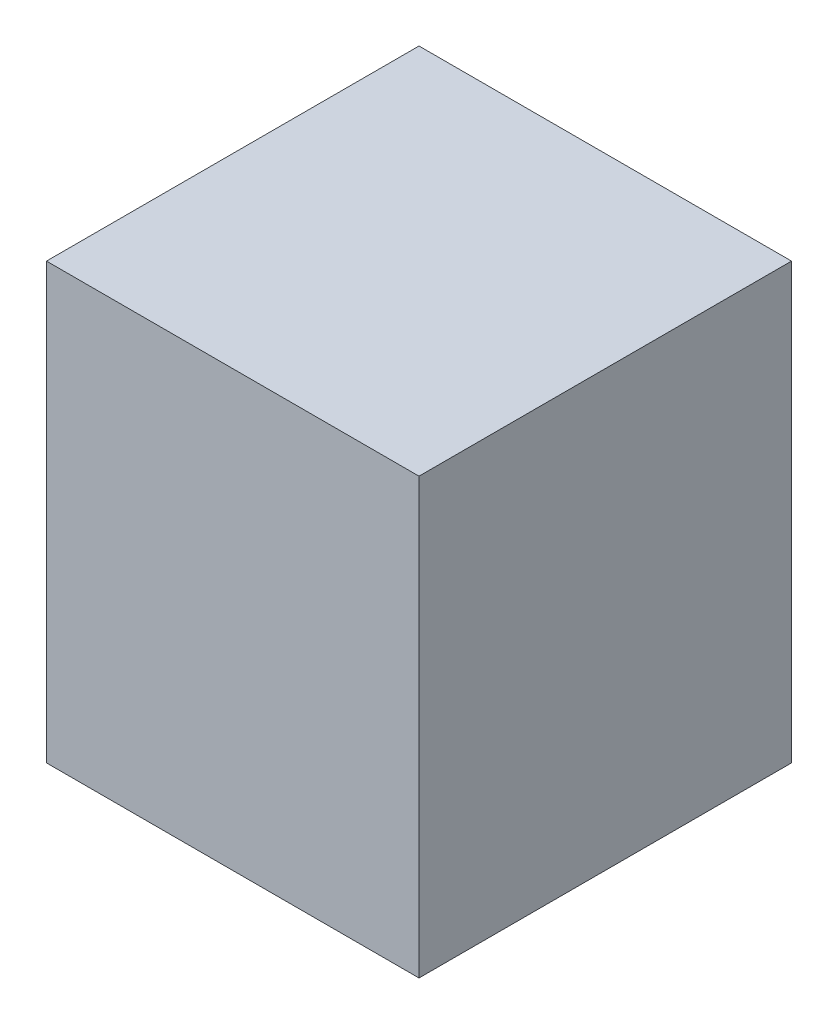
ISO-10303-21;
HEADER;
FILE_DESCRIPTION(('STEP AP214'),'2;1');
FILE_NAME('part.step','',(''),(''),'','','');
FILE_SCHEMA(('AUTOMOTIVE_DESIGN { 1 0 10303 214 1 1 1 1 }'));
ENDSEC;
DATA;
#1=APPLICATION_CONTEXT('core data for automotive mechanical design processes');
#2=APPLICATION_PROTOCOL_DEFINITION('international standard','automotive_design',2000,#1);
#3=PRODUCT_CONTEXT('',#1,'mechanical');
#4=PRODUCT('Part','Part','',(#3));
#5=PRODUCT_RELATED_PRODUCT_CATEGORY('part','',(#4));
#6=PRODUCT_DEFINITION_FORMATION('','',#4);
#7=PRODUCT_DEFINITION_CONTEXT('part definition',#1,'design');
#8=PRODUCT_DEFINITION('design','',#6,#7);
#9=PRODUCT_DEFINITION_SHAPE('','',#8);
#10=(LENGTH_UNIT() NAMED_UNIT(*) SI_UNIT(.MILLI.,.METRE.));
#11=(NAMED_UNIT(*) PLANE_ANGLE_UNIT() SI_UNIT($,.RADIAN.));
#12=(NAMED_UNIT(*) SI_UNIT($,.STERADIAN.) SOLID_ANGLE_UNIT());
#13=UNCERTAINTY_MEASURE_WITH_UNIT(LENGTH_MEASURE(1.E-05),#10,'distance_accuracy_value','');
#14=(GEOMETRIC_REPRESENTATION_CONTEXT(3) GLOBAL_UNCERTAINTY_ASSIGNED_CONTEXT((#13)) GLOBAL_UNIT_ASSIGNED_CONTEXT((#10,
#11,#12)) REPRESENTATION_CONTEXT('',''));
#15=CARTESIAN_POINT('',(0.,0.,0.));
#16=DIRECTION('',(0.,0.,1.));
#17=DIRECTION('',(1.,0.,0.));
#18=AXIS2_PLACEMENT_3D('',#15,#16,#17);
#19=CARTESIAN_POINT('',(-150.,350.,-150.));
#20=DIRECTION('',(1.,0.,0.));
#21=DIRECTION('',(0.,0.,-1.));
#22=AXIS2_PLACEMENT_3D('',#19,#20,#21);
#23=PLANE('',#22);
#24=DIRECTION('',(0.,0.,1.));
#25=VECTOR('',#24,1.);
#26=CARTESIAN_POINT('',(-150.,0.,-150.));
#27=LINE('',#26,#25);
#28=CARTESIAN_POINT('',(-150.,0.,-150.));
#29=VERTEX_POINT('',#28);
#30=CARTESIAN_POINT('',(-150.,0.,150.));
#31=VERTEX_POINT('',#30);
#32=EDGE_CURVE('E109',#29,#31,#27,.T.);
#33=ORIENTED_EDGE('',*,*,#32,.T.);
#34=DIRECTION('',(0.,-1.,0.));
#35=VECTOR('',#34,1.);
#36=CARTESIAN_POINT('',(-150.,350.,150.));
#37=LINE('',#36,#35);
#38=CARTESIAN_POINT('',(-150.,350.,150.));
#39=VERTEX_POINT('',#38);
#40=EDGE_CURVE('E11',#39,#31,#37,.T.);
#41=ORIENTED_EDGE('',*,*,#40,.F.);
#42=DIRECTION('',(0.,0.,1.));
#43=VECTOR('',#42,1.);
#44=CARTESIAN_POINT('',(-150.,350.,-150.));
#45=LINE('',#44,#43);
#46=CARTESIAN_POINT('',(-150.,350.,-150.));
#47=VERTEX_POINT('',#46);
#48=EDGE_CURVE('E93',#47,#39,#45,.T.);
#49=ORIENTED_EDGE('',*,*,#48,.F.);
#50=DIRECTION('',(0.,-1.,0.));
#51=VECTOR('',#50,1.);
#52=CARTESIAN_POINT('',(-150.,350.,-150.));
#53=LINE('',#52,#51);
#54=EDGE_CURVE('E105',#47,#29,#53,.T.);
#55=ORIENTED_EDGE('',*,*,#54,.T.);
#56=EDGE_LOOP('',(#33,#41,#49,#55));
#57=FACE_BOUND('',#56,.T.);
#58=ADVANCED_FACE('F41',(#57),#23,.F.);
#59=CARTESIAN_POINT('',(150.,350.,150.));
#60=DIRECTION('',(0.,0.,-1.));
#61=DIRECTION('',(-1.,0.,0.));
#62=AXIS2_PLACEMENT_3D('',#59,#60,#61);
#63=PLANE('',#62);
#64=DIRECTION('',(1.,0.,0.));
#65=VECTOR('',#64,1.);
#66=CARTESIAN_POINT('',(150.,0.,150.));
#67=LINE('',#66,#65);
#68=CARTESIAN_POINT('',(150.,0.,150.));
#69=VERTEX_POINT('',#68);
#70=EDGE_CURVE('E98',#31,#69,#67,.T.);
#71=ORIENTED_EDGE('',*,*,#70,.T.);
#72=DIRECTION('',(0.,-1.,0.));
#73=VECTOR('',#72,1.);
#74=CARTESIAN_POINT('',(150.,350.,150.));
#75=LINE('',#74,#73);
#76=CARTESIAN_POINT('',(150.,350.,150.));
#77=VERTEX_POINT('',#76);
#78=EDGE_CURVE('E50',#77,#69,#75,.T.);
#79=ORIENTED_EDGE('',*,*,#78,.F.);
#80=DIRECTION('',(1.,0.,0.));
#81=VECTOR('',#80,1.);
#82=CARTESIAN_POINT('',(150.,350.,150.));
#83=LINE('',#82,#81);
#84=EDGE_CURVE('E88',#39,#77,#83,.T.);
#85=ORIENTED_EDGE('',*,*,#84,.F.);
#86=ORIENTED_EDGE('',*,*,#40,.T.);
#87=EDGE_LOOP('',(#71,#79,#85,#86));
#88=FACE_BOUND('',#87,.T.);
#89=ADVANCED_FACE('F97',(#88),#63,.F.);
#90=CARTESIAN_POINT('',(150.,350.,-150.));
#91=DIRECTION('',(-1.,0.,0.));
#92=DIRECTION('',(0.,0.,1.));
#93=AXIS2_PLACEMENT_3D('',#90,#91,#92);
#94=PLANE('',#93);
#95=DIRECTION('',(0.,0.,-1.));
#96=VECTOR('',#95,1.);
#97=CARTESIAN_POINT('',(150.,0.,-150.));
#98=LINE('',#97,#96);
#99=CARTESIAN_POINT('',(150.,0.,-150.));
#100=VERTEX_POINT('',#99);
#101=EDGE_CURVE('E75',#69,#100,#98,.T.);
#102=ORIENTED_EDGE('',*,*,#101,.T.);
#103=DIRECTION('',(0.,-1.,0.));
#104=VECTOR('',#103,1.);
#105=CARTESIAN_POINT('',(150.,350.,-150.));
#106=LINE('',#105,#104);
#107=CARTESIAN_POINT('',(150.,350.,-150.));
#108=VERTEX_POINT('',#107);
#109=EDGE_CURVE('E100',#108,#100,#106,.T.);
#110=ORIENTED_EDGE('',*,*,#109,.F.);
#111=DIRECTION('',(0.,0.,-1.));
#112=VECTOR('',#111,1.);
#113=CARTESIAN_POINT('',(150.,350.,-150.));
#114=LINE('',#113,#112);
#115=EDGE_CURVE('E91',#77,#108,#114,.T.);
#116=ORIENTED_EDGE('',*,*,#115,.F.);
#117=ORIENTED_EDGE('',*,*,#78,.T.);
#118=EDGE_LOOP('',(#102,#110,#116,#117));
#119=FACE_BOUND('',#118,.T.);
#120=ADVANCED_FACE('F101',(#119),#94,.F.);
#121=CARTESIAN_POINT('',(150.,350.,-150.));
#122=DIRECTION('',(0.,0.,1.));
#123=DIRECTION('',(1.,0.,0.));
#124=AXIS2_PLACEMENT_3D('',#121,#122,#123);
#125=PLANE('',#124);
#126=DIRECTION('',(-1.,0.,0.));
#127=VECTOR('',#126,1.);
#128=CARTESIAN_POINT('',(150.,0.,-150.));
#129=LINE('',#128,#127);
#130=EDGE_CURVE('E81',#100,#29,#129,.T.);
#131=ORIENTED_EDGE('',*,*,#130,.T.);
#132=ORIENTED_EDGE('',*,*,#54,.F.);
#133=DIRECTION('',(-1.,0.,0.));
#134=VECTOR('',#133,1.);
#135=CARTESIAN_POINT('',(150.,350.,-150.));
#136=LINE('',#135,#134);
#137=EDGE_CURVE('E58',#108,#47,#136,.T.);
#138=ORIENTED_EDGE('',*,*,#137,.F.);
#139=ORIENTED_EDGE('',*,*,#109,.T.);
#140=EDGE_LOOP('',(#131,#132,#138,#139));
#141=FACE_BOUND('',#140,.T.);
#142=ADVANCED_FACE('F122',(#141),#125,.F.);
#143=CARTESIAN_POINT('',(0.,350.,0.));
#144=DIRECTION('',(0.,-1.,0.));
#145=DIRECTION('',(0.,0.,-1.));
#146=AXIS2_PLACEMENT_3D('',#143,#144,#145);
#147=PLANE('',#146);
#148=ORIENTED_EDGE('',*,*,#48,.T.);
#149=ORIENTED_EDGE('',*,*,#84,.T.);
#150=ORIENTED_EDGE('',*,*,#115,.T.);
#151=ORIENTED_EDGE('',*,*,#137,.T.);
#152=EDGE_LOOP('',(#148,#149,#150,#151));
#153=FACE_BOUND('',#152,.T.);
#154=ADVANCED_FACE('F89',(#153),#147,.F.);
#155=CARTESIAN_POINT('',(0.,0.,0.));
#156=DIRECTION('',(0.,-1.,0.));
#157=DIRECTION('',(0.,0.,-1.));
#158=AXIS2_PLACEMENT_3D('',#155,#156,#157);
#159=PLANE('',#158);
#160=ORIENTED_EDGE('',*,*,#32,.F.);
#161=ORIENTED_EDGE('',*,*,#130,.F.);
#162=ORIENTED_EDGE('',*,*,#101,.F.);
#163=ORIENTED_EDGE('',*,*,#70,.F.);
#164=EDGE_LOOP('',(#160,#161,#162,#163));
#165=FACE_BOUND('',#164,.T.);
#166=ADVANCED_FACE('F125',(#165),#159,.T.);
#167=CLOSED_SHELL('',(#58,#89,#120,#142,#154,#166));
#168=MANIFOLD_SOLID_BREP('B2',#167);
#169=ADVANCED_BREP_SHAPE_REPRESENTATION('',(#18,#168),#14);
#170=SHAPE_DEFINITION_REPRESENTATION(#9,#169);
ENDSEC;
END-ISO-10303-21;
